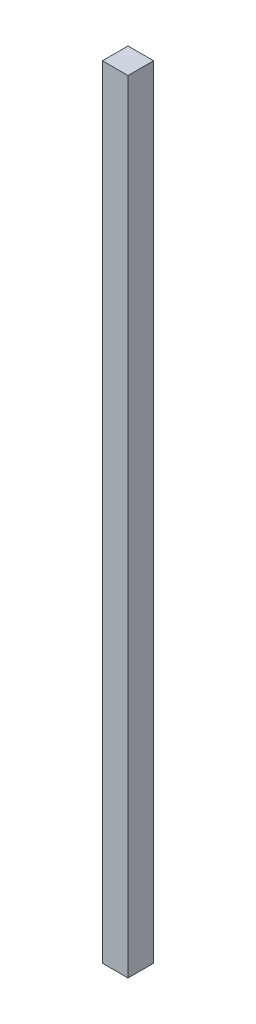
ISO-10303-21;
HEADER;
FILE_DESCRIPTION(('STEP AP214'),'2;1');
FILE_NAME('part.step','',(''),(''),'','','');
FILE_SCHEMA(('AUTOMOTIVE_DESIGN { 1 0 10303 214 1 1 1 1 }'));
ENDSEC;
DATA;
#1=APPLICATION_CONTEXT('core data for automotive mechanical design processes');
#2=APPLICATION_PROTOCOL_DEFINITION('international standard','automotive_design',2000,#1);
#3=PRODUCT_CONTEXT('',#1,'mechanical');
#4=PRODUCT('Part','Part','',(#3));
#5=PRODUCT_RELATED_PRODUCT_CATEGORY('part','',(#4));
#6=PRODUCT_DEFINITION_FORMATION('','',#4);
#7=PRODUCT_DEFINITION_CONTEXT('part definition',#1,'design');
#8=PRODUCT_DEFINITION('design','',#6,#7);
#9=PRODUCT_DEFINITION_SHAPE('','',#8);
#10=(LENGTH_UNIT() NAMED_UNIT(*) SI_UNIT(.MILLI.,.METRE.));
#11=(NAMED_UNIT(*) PLANE_ANGLE_UNIT() SI_UNIT($,.RADIAN.));
#12=(NAMED_UNIT(*) SI_UNIT($,.STERADIAN.) SOLID_ANGLE_UNIT());
#13=UNCERTAINTY_MEASURE_WITH_UNIT(LENGTH_MEASURE(1.E-05),#10,'distance_accuracy_value','');
#14=(GEOMETRIC_REPRESENTATION_CONTEXT(3) GLOBAL_UNCERTAINTY_ASSIGNED_CONTEXT((#13)) GLOBAL_UNIT_ASSIGNED_CONTEXT((#10,
#11,#12)) REPRESENTATION_CONTEXT('',''));
#15=CARTESIAN_POINT('',(0.,0.,0.));
#16=DIRECTION('',(0.,0.,1.));
#17=DIRECTION('',(1.,0.,0.));
#18=AXIS2_PLACEMENT_3D('',#15,#16,#17);
#19=CARTESIAN_POINT('',(12.7,775.97,12.7));
#20=DIRECTION('',(-1.,0.,0.));
#21=DIRECTION('',(0.,0.,1.));
#22=AXIS2_PLACEMENT_3D('',#19,#20,#21);
#23=PLANE('',#22);
#24=DIRECTION('',(0.,0.,-1.));
#25=VECTOR('',#24,1.);
#26=CARTESIAN_POINT('',(12.7,0.,12.7));
#27=LINE('',#26,#25);
#28=CARTESIAN_POINT('',(12.7,0.,12.7));
#29=VERTEX_POINT('',#28);
#30=CARTESIAN_POINT('',(12.7,0.,-12.7));
#31=VERTEX_POINT('',#30);
#32=EDGE_CURVE('E107',#29,#31,#27,.T.);
#33=ORIENTED_EDGE('',*,*,#32,.T.);
#34=DIRECTION('',(0.,-1.,0.));
#35=VECTOR('',#34,1.);
#36=CARTESIAN_POINT('',(12.7,775.97,-12.7));
#37=LINE('',#36,#35);
#38=CARTESIAN_POINT('',(12.7,775.97,-12.7));
#39=VERTEX_POINT('',#38);
#40=EDGE_CURVE('E11',#39,#31,#37,.T.);
#41=ORIENTED_EDGE('',*,*,#40,.F.);
#42=DIRECTION('',(0.,0.,-1.));
#43=VECTOR('',#42,1.);
#44=CARTESIAN_POINT('',(12.7,775.97,12.7));
#45=LINE('',#44,#43);
#46=CARTESIAN_POINT('',(12.7,775.97,12.7));
#47=VERTEX_POINT('',#46);
#48=EDGE_CURVE('E91',#47,#39,#45,.T.);
#49=ORIENTED_EDGE('',*,*,#48,.F.);
#50=DIRECTION('',(0.,-1.,0.));
#51=VECTOR('',#50,1.);
#52=CARTESIAN_POINT('',(12.7,775.97,12.7));
#53=LINE('',#52,#51);
#54=EDGE_CURVE('E103',#47,#29,#53,.T.);
#55=ORIENTED_EDGE('',*,*,#54,.T.);
#56=EDGE_LOOP('',(#33,#41,#49,#55));
#57=FACE_BOUND('',#56,.T.);
#58=ADVANCED_FACE('F39',(#57),#23,.F.);
#59=CARTESIAN_POINT('',(-12.7,775.97,-12.7));
#60=DIRECTION('',(0.,0.,1.));
#61=DIRECTION('',(1.,0.,0.));
#62=AXIS2_PLACEMENT_3D('',#59,#60,#61);
#63=PLANE('',#62);
#64=DIRECTION('',(-1.,0.,0.));
#65=VECTOR('',#64,1.);
#66=CARTESIAN_POINT('',(-12.7,0.,-12.7));
#67=LINE('',#66,#65);
#68=CARTESIAN_POINT('',(-12.7,0.,-12.7));
#69=VERTEX_POINT('',#68);
#70=EDGE_CURVE('E96',#31,#69,#67,.T.);
#71=ORIENTED_EDGE('',*,*,#70,.T.);
#72=DIRECTION('',(0.,-1.,0.));
#73=VECTOR('',#72,1.);
#74=CARTESIAN_POINT('',(-12.7,775.97,-12.7));
#75=LINE('',#74,#73);
#76=CARTESIAN_POINT('',(-12.7,775.97,-12.7));
#77=VERTEX_POINT('',#76);
#78=EDGE_CURVE('E48',#77,#69,#75,.T.);
#79=ORIENTED_EDGE('',*,*,#78,.F.);
#80=DIRECTION('',(-1.,0.,0.));
#81=VECTOR('',#80,1.);
#82=CARTESIAN_POINT('',(-12.7,775.97,-12.7));
#83=LINE('',#82,#81);
#84=EDGE_CURVE('E86',#39,#77,#83,.T.);
#85=ORIENTED_EDGE('',*,*,#84,.F.);
#86=ORIENTED_EDGE('',*,*,#40,.T.);
#87=EDGE_LOOP('',(#71,#79,#85,#86));
#88=FACE_BOUND('',#87,.T.);
#89=ADVANCED_FACE('F95',(#88),#63,.F.);
#90=CARTESIAN_POINT('',(-12.7,775.97,12.7));
#91=DIRECTION('',(1.,0.,0.));
#92=DIRECTION('',(0.,0.,-1.));
#93=AXIS2_PLACEMENT_3D('',#90,#91,#92);
#94=PLANE('',#93);
#95=DIRECTION('',(0.,0.,1.));
#96=VECTOR('',#95,1.);
#97=CARTESIAN_POINT('',(-12.7,0.,12.7));
#98=LINE('',#97,#96);
#99=CARTESIAN_POINT('',(-12.7,0.,12.7));
#100=VERTEX_POINT('',#99);
#101=EDGE_CURVE('E73',#69,#100,#98,.T.);
#102=ORIENTED_EDGE('',*,*,#101,.T.);
#103=DIRECTION('',(0.,-1.,0.));
#104=VECTOR('',#103,1.);
#105=CARTESIAN_POINT('',(-12.7,775.97,12.7));
#106=LINE('',#105,#104);
#107=CARTESIAN_POINT('',(-12.7,775.97,12.7));
#108=VERTEX_POINT('',#107);
#109=EDGE_CURVE('E98',#108,#100,#106,.T.);
#110=ORIENTED_EDGE('',*,*,#109,.F.);
#111=DIRECTION('',(0.,0.,1.));
#112=VECTOR('',#111,1.);
#113=CARTESIAN_POINT('',(-12.7,775.97,12.7));
#114=LINE('',#113,#112);
#115=EDGE_CURVE('E89',#77,#108,#114,.T.);
#116=ORIENTED_EDGE('',*,*,#115,.F.);
#117=ORIENTED_EDGE('',*,*,#78,.T.);
#118=EDGE_LOOP('',(#102,#110,#116,#117));
#119=FACE_BOUND('',#118,.T.);
#120=ADVANCED_FACE('F99',(#119),#94,.F.);
#121=CARTESIAN_POINT('',(-12.7,775.97,12.7));
#122=DIRECTION('',(0.,0.,-1.));
#123=DIRECTION('',(-1.,0.,0.));
#124=AXIS2_PLACEMENT_3D('',#121,#122,#123);
#125=PLANE('',#124);
#126=DIRECTION('',(1.,0.,0.));
#127=VECTOR('',#126,1.);
#128=CARTESIAN_POINT('',(-12.7,0.,12.7));
#129=LINE('',#128,#127);
#130=EDGE_CURVE('E79',#100,#29,#129,.T.);
#131=ORIENTED_EDGE('',*,*,#130,.T.);
#132=ORIENTED_EDGE('',*,*,#54,.F.);
#133=DIRECTION('',(1.,0.,0.));
#134=VECTOR('',#133,1.);
#135=CARTESIAN_POINT('',(-12.7,775.97,12.7));
#136=LINE('',#135,#134);
#137=EDGE_CURVE('E56',#108,#47,#136,.T.);
#138=ORIENTED_EDGE('',*,*,#137,.F.);
#139=ORIENTED_EDGE('',*,*,#109,.T.);
#140=EDGE_LOOP('',(#131,#132,#138,#139));
#141=FACE_BOUND('',#140,.T.);
#142=ADVANCED_FACE('F120',(#141),#125,.F.);
#143=CARTESIAN_POINT('',(0.,775.97,0.));
#144=DIRECTION('',(0.,-1.,0.));
#145=DIRECTION('',(0.,0.,-1.));
#146=AXIS2_PLACEMENT_3D('',#143,#144,#145);
#147=PLANE('',#146);
#148=ORIENTED_EDGE('',*,*,#48,.T.);
#149=ORIENTED_EDGE('',*,*,#84,.T.);
#150=ORIENTED_EDGE('',*,*,#115,.T.);
#151=ORIENTED_EDGE('',*,*,#137,.T.);
#152=EDGE_LOOP('',(#148,#149,#150,#151));
#153=FACE_BOUND('',#152,.T.);
#154=ADVANCED_FACE('F87',(#153),#147,.F.);
#155=CARTESIAN_POINT('',(0.,0.,0.));
#156=DIRECTION('',(0.,-1.,0.));
#157=DIRECTION('',(0.,0.,-1.));
#158=AXIS2_PLACEMENT_3D('',#155,#156,#157);
#159=PLANE('',#158);
#160=ORIENTED_EDGE('',*,*,#32,.F.);
#161=ORIENTED_EDGE('',*,*,#130,.F.);
#162=ORIENTED_EDGE('',*,*,#101,.F.);
#163=ORIENTED_EDGE('',*,*,#70,.F.);
#164=EDGE_LOOP('',(#160,#161,#162,#163));
#165=FACE_BOUND('',#164,.T.);
#166=ADVANCED_FACE('F123',(#165),#159,.T.);
#167=CLOSED_SHELL('',(#58,#89,#120,#142,#154,#166));
#168=MANIFOLD_SOLID_BREP('B2',#167);
#169=ADVANCED_BREP_SHAPE_REPRESENTATION('',(#18,#168),#14);
#170=SHAPE_DEFINITION_REPRESENTATION(#9,#169);
ENDSEC;
END-ISO-10303-21;
